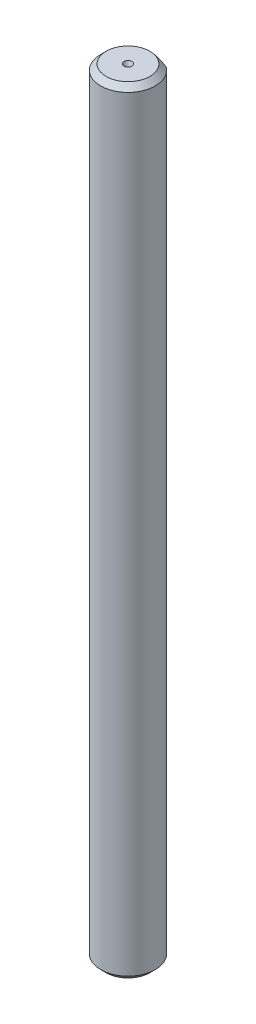
ISO-10303-21;
HEADER;
FILE_DESCRIPTION(('STEP AP214'),'2;1');
FILE_NAME('part.step','',(''),(''),'','','');
FILE_SCHEMA(('AUTOMOTIVE_DESIGN { 1 0 10303 214 1 1 1 1 }'));
ENDSEC;
DATA;
#1=APPLICATION_CONTEXT('core data for automotive mechanical design processes');
#2=APPLICATION_PROTOCOL_DEFINITION('international standard','automotive_design',2000,#1);
#3=PRODUCT_CONTEXT('',#1,'mechanical');
#4=PRODUCT('Part','Part','',(#3));
#5=PRODUCT_RELATED_PRODUCT_CATEGORY('part','',(#4));
#6=PRODUCT_DEFINITION_FORMATION('','',#4);
#7=PRODUCT_DEFINITION_CONTEXT('part definition',#1,'design');
#8=PRODUCT_DEFINITION('design','',#6,#7);
#9=PRODUCT_DEFINITION_SHAPE('','',#8);
#10=(LENGTH_UNIT() NAMED_UNIT(*) SI_UNIT(.MILLI.,.METRE.));
#11=(NAMED_UNIT(*) PLANE_ANGLE_UNIT() SI_UNIT($,.RADIAN.));
#12=(NAMED_UNIT(*) SI_UNIT($,.STERADIAN.) SOLID_ANGLE_UNIT());
#13=UNCERTAINTY_MEASURE_WITH_UNIT(LENGTH_MEASURE(1.E-05),#10,'distance_accuracy_value','');
#14=(GEOMETRIC_REPRESENTATION_CONTEXT(3) GLOBAL_UNCERTAINTY_ASSIGNED_CONTEXT((#13)) GLOBAL_UNIT_ASSIGNED_CONTEXT((#10,
#11,#12)) REPRESENTATION_CONTEXT('',''));
#15=CARTESIAN_POINT('',(0.,0.,0.));
#16=DIRECTION('',(0.,0.,1.));
#17=DIRECTION('',(1.,0.,0.));
#18=AXIS2_PLACEMENT_3D('',#15,#16,#17);
#19=CARTESIAN_POINT('',(0.,71.,0.));
#20=DIRECTION('',(0.,-1.,0.));
#21=DIRECTION('',(0.,0.,-1.));
#22=AXIS2_PLACEMENT_3D('',#19,#20,#21);
#23=CYLINDRICAL_SURFACE('',#22,2.5);
#24=CARTESIAN_POINT('',(0.,70.5,0.));
#25=DIRECTION('',(0.,1.,0.));
#26=DIRECTION('',(0.,0.,1.));
#27=AXIS2_PLACEMENT_3D('',#24,#25,#26);
#28=CIRCLE('',#27,2.5);
#29=CARTESIAN_POINT('',(1.5,70.5,-2.));
#30=VERTEX_POINT('',#29);
#31=CARTESIAN_POINT('',(-1.5,70.5,-2.));
#32=VERTEX_POINT('',#31);
#33=EDGE_CURVE('E84',#30,#32,#28,.F.);
#34=ORIENTED_EDGE('',*,*,#33,.T.);
#35=DIRECTION('',(0.,1.,0.));
#36=VECTOR('',#35,1.);
#37=CARTESIAN_POINT('',(-1.5,56.,-2.));
#38=LINE('',#37,#36);
#39=CARTESIAN_POINT('',(-1.5,56.,-2.));
#40=VERTEX_POINT('',#39);
#41=EDGE_CURVE('E78',#40,#32,#38,.T.);
#42=ORIENTED_EDGE('',*,*,#41,.F.);
#43=CARTESIAN_POINT('',(0.,56.,0.));
#44=DIRECTION('',(0.,1.,0.));
#45=DIRECTION('',(0.,0.,1.));
#46=AXIS2_PLACEMENT_3D('',#43,#44,#45);
#47=CIRCLE('',#46,2.5);
#48=CARTESIAN_POINT('',(1.5,56.,-2.));
#49=VERTEX_POINT('',#48);
#50=EDGE_CURVE('E69',#49,#40,#47,.T.);
#51=ORIENTED_EDGE('',*,*,#50,.F.);
#52=DIRECTION('',(0.,1.,0.));
#53=VECTOR('',#52,1.);
#54=CARTESIAN_POINT('',(1.5,56.,-2.));
#55=LINE('',#54,#53);
#56=EDGE_CURVE('E79',#49,#30,#55,.T.);
#57=ORIENTED_EDGE('',*,*,#56,.T.);
#58=EDGE_LOOP('',(#34,#42,#51,#57));
#59=FACE_BOUND('',#58,.T.);
#60=CARTESIAN_POINT('',(0.,0.499999999999987,0.));
#61=DIRECTION('',(0.,1.,0.));
#62=DIRECTION('',(0.,0.,1.));
#63=AXIS2_PLACEMENT_3D('',#60,#61,#62);
#64=CIRCLE('',#63,2.5);
#65=CARTESIAN_POINT('',(0.,0.499999999999987,2.5));
#66=VERTEX_POINT('',#65);
#67=EDGE_CURVE('E92',#66,#66,#64,.T.);
#68=ORIENTED_EDGE('',*,*,#67,.T.);
#69=EDGE_LOOP('',(#68));
#70=FACE_BOUND('',#69,.T.);
#71=ADVANCED_FACE('F34',(#59,#70),#23,.T.);
#72=CARTESIAN_POINT('',(0.,71.,0.));
#73=DIRECTION('',(0.,1.,0.));
#74=DIRECTION('',(0.,0.,1.));
#75=AXIS2_PLACEMENT_3D('',#72,#73,#74);
#76=PLANE('',#75);
#77=CARTESIAN_POINT('',(0.,71.,0.));
#78=DIRECTION('',(0.,1.,0.));
#79=DIRECTION('',(0.,0.,1.));
#80=AXIS2_PLACEMENT_3D('',#77,#78,#79);
#81=CIRCLE('',#80,0.368933834947047);
#82=CARTESIAN_POINT('',(0.,71.,0.368933834947047));
#83=VERTEX_POINT('',#82);
#84=EDGE_CURVE('E86',#83,#83,#81,.T.);
#85=ORIENTED_EDGE('',*,*,#84,.F.);
#86=EDGE_LOOP('',(#85));
#87=FACE_BOUND('',#86,.T.);
#88=CARTESIAN_POINT('',(0.,71.,0.));
#89=DIRECTION('',(0.,1.,0.));
#90=DIRECTION('',(0.,0.,1.));
#91=AXIS2_PLACEMENT_3D('',#88,#89,#90);
#92=CIRCLE('',#91,2.);
#93=CARTESIAN_POINT('',(0.,71.,-2.));
#94=VERTEX_POINT('',#93);
#95=EDGE_CURVE('E97',#94,#94,#92,.T.);
#96=ORIENTED_EDGE('',*,*,#95,.T.);
#97=EDGE_LOOP('',(#96));
#98=FACE_BOUND('',#97,.T.);
#99=ADVANCED_FACE('F113',(#87,#98),#76,.T.);
#100=CARTESIAN_POINT('',(0.,0.,0.));
#101=DIRECTION('',(0.,1.,0.));
#102=DIRECTION('',(0.,0.,1.));
#103=AXIS2_PLACEMENT_3D('',#100,#101,#102);
#104=PLANE('',#103);
#105=CARTESIAN_POINT('',(0.,0.,0.));
#106=DIRECTION('',(0.,1.,0.));
#107=DIRECTION('',(0.,0.,1.));
#108=AXIS2_PLACEMENT_3D('',#105,#106,#107);
#109=CIRCLE('',#108,2.00000000000001);
#110=CARTESIAN_POINT('',(0.,0.,2.00000000000001));
#111=VERTEX_POINT('',#110);
#112=EDGE_CURVE('E95',#111,#111,#109,.F.);
#113=ORIENTED_EDGE('',*,*,#112,.T.);
#114=EDGE_LOOP('',(#113));
#115=FACE_BOUND('',#114,.T.);
#116=ADVANCED_FACE('F110',(#115),#104,.F.);
#117=CARTESIAN_POINT('',(0.,0.499999999999987,0.));
#118=DIRECTION('',(0.,1.,0.));
#119=DIRECTION('',(0.,0.,1.));
#120=AXIS2_PLACEMENT_3D('',#117,#118,#119);
#121=CONICAL_SURFACE('',#120,2.5,0.785398163397453);
#122=ORIENTED_EDGE('',*,*,#112,.F.);
#123=EDGE_LOOP('',(#122));
#124=FACE_BOUND('',#123,.T.);
#125=ORIENTED_EDGE('',*,*,#67,.F.);
#126=EDGE_LOOP('',(#125));
#127=FACE_BOUND('',#126,.T.);
#128=ADVANCED_FACE('F104',(#124,#127),#121,.T.);
#129=CARTESIAN_POINT('',(0.,71.,0.));
#130=DIRECTION('',(0.,-1.,0.));
#131=DIRECTION('',(0.,0.,-1.));
#132=AXIS2_PLACEMENT_3D('',#129,#130,#131);
#133=CONICAL_SURFACE('',#132,2.,0.785398163397446);
#134=CARTESIAN_POINT('',(-3.05046237304907,69.3523540893628,-2.));
#135=CARTESIAN_POINT('',(-2.97819280230489,69.4127795768134,-2.));
#136=CARTESIAN_POINT('',(-2.90561482282155,69.4728409726599,-2.));
#137=CARTESIAN_POINT('',(-2.75969297896042,69.5920517840241,-2.));
#138=CARTESIAN_POINT('',(-2.68634898156782,69.6512010365838,-2.));
#139=CARTESIAN_POINT('',(-2.53824127010594,69.7688032751404,-2.));
#140=CARTESIAN_POINT('',(-2.46347114157042,69.8272482043826,-2.));
#141=CARTESIAN_POINT('',(-2.31285154645429,69.9427230300633,-2.));
#142=CARTESIAN_POINT('',(-2.2370021522091,69.9997530206387,-2.));
#143=CARTESIAN_POINT('',(-2.07682509237634,70.1172986547914,-2.));
#144=CARTESIAN_POINT('',(-1.9923690144222,70.1776401136847,-2.));
#145=CARTESIAN_POINT('',(-1.82153234384277,70.2955304544415,-2.));
#146=CARTESIAN_POINT('',(-1.73515197512684,70.3530796587592,-2.));
#147=CARTESIAN_POINT('',(-1.56024154108809,70.4642937472491,-2.));
#148=CARTESIAN_POINT('',(-1.47171804140618,70.5179688790696,-2.));
#149=CARTESIAN_POINT('',(-1.29180406288052,70.6202357304425,-2.));
#150=CARTESIAN_POINT('',(-1.20041520429801,70.6688302578395,-2.));
#151=CARTESIAN_POINT('',(-1.030116488509,70.7513144320976,-2.));
#152=CARTESIAN_POINT('',(-0.951741952724334,70.786297973025,-2.));
#153=CARTESIAN_POINT('',(-0.79242093010037,70.8499760783841,-2.));
#154=CARTESIAN_POINT('',(-0.711474142155232,70.8786699034184,-2.));
#155=CARTESIAN_POINT('',(-0.548849154664487,70.9274760575201,-2.));
#156=CARTESIAN_POINT('',(-0.467222590868758,70.9477569737081,-2.));
#157=CARTESIAN_POINT('',(-0.302191824156156,70.978915332396,-2.));
#158=CARTESIAN_POINT('',(-0.218788938845118,70.9897995120803,-2.));
#159=CARTESIAN_POINT('',(-0.0726414802662715,70.9996534169534,-2.));
#160=CARTESIAN_POINT('',(-0.0100481773359509,71.0009523808962,-2.));
#161=CARTESIAN_POINT('',(0.114978890107864,70.9976715491136,-2.));
#162=CARTESIAN_POINT('',(0.177412672952461,70.9930924623945,-2.));
#163=CARTESIAN_POINT('',(0.301925112508527,70.9782893415559,-2.));
#164=CARTESIAN_POINT('',(0.364000234355802,70.9680360775351,-2.));
#165=CARTESIAN_POINT('',(0.487083671249213,70.9424231399316,-2.));
#166=CARTESIAN_POINT('',(0.548091725407746,70.9270622354544,-2.));
#167=CARTESIAN_POINT('',(0.701442839011809,70.8824293459371,-2.));
#168=CARTESIAN_POINT('',(0.79290189489099,70.8501257786996,-2.));
#169=CARTESIAN_POINT('',(0.972597599225778,70.77757637924,-2.));
#170=CARTESIAN_POINT('',(1.06083171657374,70.7373244608871,-2.));
#171=CARTESIAN_POINT('',(1.23534467028215,70.6504715899035,-2.));
#172=CARTESIAN_POINT('',(1.32158961030164,70.6038032989955,-2.));
#173=CARTESIAN_POINT('',(1.44900594293518,70.5305025175874,-2.));
#174=CARTESIAN_POINT('',(1.49114622438879,70.5055235009586,-2.));
#175=CARTESIAN_POINT('',(1.57484169622225,70.4546072618461,-2.));
#176=CARTESIAN_POINT('',(1.6163969172825,70.4286700898682,-2.));
#177=CARTESIAN_POINT('',(1.7634943431341,70.334807350793,-2.));
#178=CARTESIAN_POINT('',(1.86757579691446,70.2645905210021,-2.));
#179=CARTESIAN_POINT('',(2.0730838154575,70.1203584388146,-2.));
#180=CARTESIAN_POINT('',(2.17450959092299,70.0463420760785,-2.));
#181=CARTESIAN_POINT('',(2.37537283025658,69.8954874039309,-2.));
#182=CARTESIAN_POINT('',(2.47480845930885,69.8186466603806,-2.));
#183=CARTESIAN_POINT('',(2.67205501779372,69.6629023233612,-2.));
#184=CARTESIAN_POINT('',(2.76986583280206,69.5839985856085,-2.));
#185=CARTESIAN_POINT('',(2.96457124651359,69.4243085881951,-2.));
#186=CARTESIAN_POINT('',(3.06146081511226,69.3435162101495,-2.));
#187=CARTESIAN_POINT('',(3.25419299320949,69.1806906528786,-2.));
#188=CARTESIAN_POINT('',(3.3500355792903,69.0986574459974,-2.));
#189=CARTESIAN_POINT('',(3.63619070660152,68.8511868996503,-2.));
#190=CARTESIAN_POINT('',(3.82523909459796,68.6842886305257,-2.));
#191=CARTESIAN_POINT('',(4.17809082313825,68.3684677439524,-2.));
#192=CARTESIAN_POINT('',(4.34215822007578,68.219838436103,-2.));
#193=CARTESIAN_POINT('',(4.66899589250916,67.9211099646972,-2.));
#194=CARTESIAN_POINT('',(4.83176596083719,67.7710105745903,-2.));
#195=CARTESIAN_POINT('',(5.15506503563188,67.4708858166161,-2.));
#196=CARTESIAN_POINT('',(5.31560166313852,67.3208686430965,-2.));
#197=CARTESIAN_POINT('',(5.63586427489201,67.0200316423801,-2.));
#198=CARTESIAN_POINT('',(5.79559040677761,66.8692119724288,-2.));
#199=CARTESIAN_POINT('',(5.9550293776425,66.7180914613005,-2.));
#200=B_SPLINE_CURVE_WITH_KNOTS('',3,(#134,#135,#136,#137,#138,#139,#140,#141,#142,#143,#144,
#145,#146,#147,#148,#149,#150,#151,#152,#153,#154,#155,#156,#157,#158,#159,#160,#161,#162,#163,
#164,#165,#166,#167,#168,#169,#170,#171,#172,#173,#174,#175,#176,#177,#178,#179,#180,#181,#182,
#183,#184,#185,#186,#187,#188,#189,#190,#191,#192,#193,#194,#195,#196,#197,#198,#199),
.UNSPECIFIED.,.F.,.F.,(4,2,2,2,2,2,2,2,2,2,2,2,2,2,2,2,2,2,2,2,2,2,2,2,2,2,2,2,2,2,2,2,4),(0.,
0.282611147338683,0.565272212613808,0.849964297298593,1.1346373901656,1.44598770084532,
1.75730197028675,2.06776003965402,2.37804561420926,2.63532314556343,2.89263090538034,
3.1444992645464,3.39618689116324,3.58374175238014,3.77127399298788,3.95978140102543,
4.14833427059229,4.43878724943566,4.72946349947765,5.02346365278068,5.17041625961875,
5.31736113138892,5.69387889032201,6.07050731268035,6.4474683076896,6.82445573782934,
7.20290648721733,7.5813656841177,8.33786130824478,9.00199051543549,9.66622373268931,
10.325382616298,10.9844167767548),.UNSPECIFIED.);
#201=EDGE_CURVE('E11',#32,#94,#200,.T.);
#202=ORIENTED_EDGE('',*,*,#201,.F.);
#203=ORIENTED_EDGE('',*,*,#33,.F.);
#204=EDGE_CURVE('E39',#94,#30,#200,.T.);
#205=ORIENTED_EDGE('',*,*,#204,.F.);
#206=ORIENTED_EDGE('',*,*,#95,.F.);
#207=EDGE_LOOP('',(#202,#203,#205,#206));
#208=FACE_BOUND('',#207,.T.);
#209=ADVANCED_FACE('F36',(#208),#133,.T.);
#210=CARTESIAN_POINT('',(0.,71.,0.));
#211=DIRECTION('',(0.,1.,0.));
#212=DIRECTION('',(0.,0.,1.));
#213=AXIS2_PLACEMENT_3D('',#210,#211,#212);
#214=CONICAL_SURFACE('',#213,0.368933834947047,0.383972435438753);
#215=CARTESIAN_POINT('',(0.,70.0868567153421,0.));
#216=VERTEX_POINT('',#215);
#217=VERTEX_LOOP('',#216);
#218=FACE_BOUND('',#217,.T.);
#219=ORIENTED_EDGE('',*,*,#84,.T.);
#220=EDGE_LOOP('',(#219));
#221=FACE_BOUND('',#220,.T.);
#222=ADVANCED_FACE('F103',(#218,#221),#214,.F.);
#223=CARTESIAN_POINT('',(-1.5,56.,-2.));
#224=DIRECTION('',(0.,0.,1.));
#225=DIRECTION('',(1.,0.,0.));
#226=AXIS2_PLACEMENT_3D('',#223,#224,#225);
#227=PLANE('',#226);
#228=ORIENTED_EDGE('',*,*,#201,.T.);
#229=ORIENTED_EDGE('',*,*,#204,.T.);
#230=ORIENTED_EDGE('',*,*,#56,.F.);
#231=DIRECTION('',(1.,0.,0.));
#232=VECTOR('',#231,1.);
#233=CARTESIAN_POINT('',(-1.5,56.,-2.));
#234=LINE('',#233,#232);
#235=EDGE_CURVE('E72',#40,#49,#234,.T.);
#236=ORIENTED_EDGE('',*,*,#235,.F.);
#237=ORIENTED_EDGE('',*,*,#41,.T.);
#238=EDGE_LOOP('',(#228,#229,#230,#236,#237));
#239=FACE_BOUND('',#238,.T.);
#240=ADVANCED_FACE('F77',(#239),#227,.F.);
#241=CARTESIAN_POINT('',(0.,56.,0.));
#242=DIRECTION('',(0.,1.,0.));
#243=DIRECTION('',(0.,0.,1.));
#244=AXIS2_PLACEMENT_3D('',#241,#242,#243);
#245=PLANE('',#244);
#246=ORIENTED_EDGE('',*,*,#50,.T.);
#247=ORIENTED_EDGE('',*,*,#235,.T.);
#248=EDGE_LOOP('',(#246,#247));
#249=FACE_BOUND('',#248,.T.);
#250=ADVANCED_FACE('F71',(#249),#245,.T.);
#251=CLOSED_SHELL('',(#71,#99,#116,#128,#209,#222,#240,#250));
#252=MANIFOLD_SOLID_BREP('B2',#251);
#253=ADVANCED_BREP_SHAPE_REPRESENTATION('',(#18,#252),#14);
#254=SHAPE_DEFINITION_REPRESENTATION(#9,#253);
ENDSEC;
END-ISO-10303-21;
